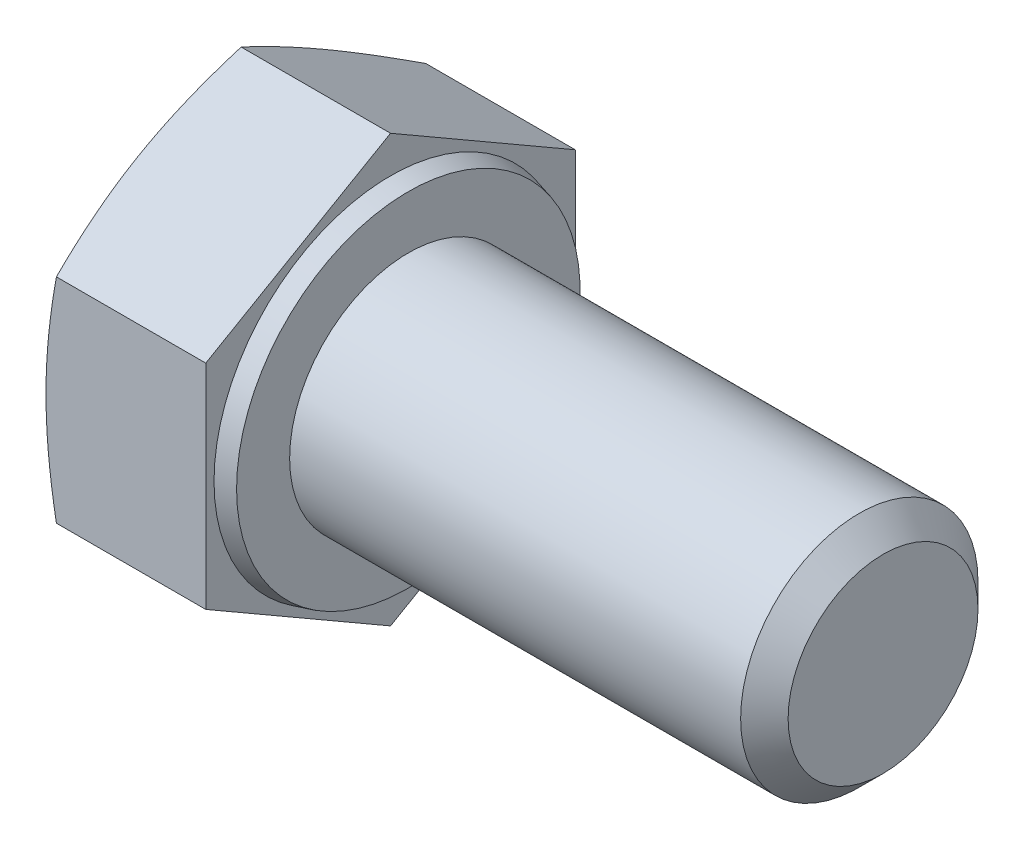
ISO-10303-21;
HEADER;
FILE_DESCRIPTION(('STEP AP214'),'2;1');
FILE_NAME('part.step','',(''),(''),'','','');
FILE_SCHEMA(('AUTOMOTIVE_DESIGN { 1 0 10303 214 1 1 1 1 }'));
ENDSEC;
DATA;
#1=APPLICATION_CONTEXT('core data for automotive mechanical design processes');
#2=APPLICATION_PROTOCOL_DEFINITION('international standard','automotive_design',2000,#1);
#3=PRODUCT_CONTEXT('',#1,'mechanical');
#4=PRODUCT('Part','Part','',(#3));
#5=PRODUCT_RELATED_PRODUCT_CATEGORY('part','',(#4));
#6=PRODUCT_DEFINITION_FORMATION('','',#4);
#7=PRODUCT_DEFINITION_CONTEXT('part definition',#1,'design');
#8=PRODUCT_DEFINITION('design','',#6,#7);
#9=PRODUCT_DEFINITION_SHAPE('','',#8);
#10=(LENGTH_UNIT() NAMED_UNIT(*) SI_UNIT(.MILLI.,.METRE.));
#11=(NAMED_UNIT(*) PLANE_ANGLE_UNIT() SI_UNIT($,.RADIAN.));
#12=(NAMED_UNIT(*) SI_UNIT($,.STERADIAN.) SOLID_ANGLE_UNIT());
#13=UNCERTAINTY_MEASURE_WITH_UNIT(LENGTH_MEASURE(1.E-05),#10,'distance_accuracy_value','');
#14=(GEOMETRIC_REPRESENTATION_CONTEXT(3) GLOBAL_UNCERTAINTY_ASSIGNED_CONTEXT((#13)) GLOBAL_UNIT_ASSIGNED_CONTEXT((#10,
#11,#12)) REPRESENTATION_CONTEXT('',''));
#15=CARTESIAN_POINT('',(0.,0.,0.));
#16=DIRECTION('',(0.,0.,1.));
#17=DIRECTION('',(1.,0.,0.));
#18=AXIS2_PLACEMENT_3D('',#15,#16,#17);
#19=CARTESIAN_POINT('',(16.5999999999999,-3.595,-6.22672265321011));
#20=DIRECTION('',(0.,-0.866025403784439,-0.5));
#21=DIRECTION('',(0.,0.5,-0.866025403784439));
#22=AXIS2_PLACEMENT_3D('',#19,#20,#21);
#23=PLANE('',#22);
#24=DIRECTION('',(-1.,0.,0.));
#25=VECTOR('',#24,1.);
#26=CARTESIAN_POINT('',(16.5999999999999,-7.19,0.));
#27=LINE('',#26,#25);
#28=CARTESIAN_POINT('',(0.,-7.19,0.));
#29=VERTEX_POINT('',#28);
#30=CARTESIAN_POINT('',(-5.03389102967511,-7.19,0.));
#31=VERTEX_POINT('',#30);
#32=EDGE_CURVE('E58',#29,#31,#27,.T.);
#33=ORIENTED_EDGE('',*,*,#32,.T.);
#34=CARTESIAN_POINT('',(-5.03384900100014,-7.19011547005384,0.0002));
#35=CARTESIAN_POINT('',(-5.08805963076519,-7.04122910407722,-0.257678750425791));
#36=CARTESIAN_POINT('',(-5.13737359308155,-6.89185177286806,-0.516407877579102));
#37=CARTESIAN_POINT('',(-5.22413389520894,-6.59212583670845,-1.0355484273537));
#38=CARTESIAN_POINT('',(-5.26157094835133,-6.44177656505055,-1.29596100474615));
#39=CARTESIAN_POINT('',(-5.32212431475841,-6.14177529234696,-1.81557845140411));
#40=CARTESIAN_POINT('',(-5.34537270513493,-5.99213014273963,-2.07477145363024));
#41=CARTESIAN_POINT('',(-5.37655533214507,-5.69248989384581,-2.59376358870692));
#42=CARTESIAN_POINT('',(-5.38449531124956,-5.54249494692291,-2.85356245765599));
#43=CARTESIAN_POINT('',(-5.38449531124956,-5.2425050530771,-3.37316019555412));
#44=CARTESIAN_POINT('',(-5.37655533214507,-5.09251010615419,-3.63295906450319));
#45=CARTESIAN_POINT('',(-5.34537270513493,-4.79286985726037,-4.15195119957987));
#46=CARTESIAN_POINT('',(-5.32212431475841,-4.64322470765305,-4.41114420180601));
#47=CARTESIAN_POINT('',(-5.26157094835133,-4.34322343494945,-4.93076164846397));
#48=CARTESIAN_POINT('',(-5.22413389520894,-4.19287416329156,-5.19117422585641));
#49=CARTESIAN_POINT('',(-5.13737359308155,-3.89314822713194,-5.71031477563101));
#50=CARTESIAN_POINT('',(-5.08805963076519,-3.74377089592278,-5.96904390278432));
#51=CARTESIAN_POINT('',(-5.03384900100014,-3.59488452994616,-6.22692265321011));
#52=B_SPLINE_CURVE_WITH_KNOTS('',3,(#34,#35,#36,#37,#38,#39,#40,#41,#42,#43,#44,#45,#46,#47,#48,
#49,#50,#51),.UNSPECIFIED.,.F.,.F.,(4,2,2,2,2,2,2,2,4),(0.,0.908095057252449,1.81689842260343,
2.71710763162562,3.61697908961632,4.51685054760702,5.41705975662921,6.32586312198019,
7.23395817923264),.UNSPECIFIED.);
#53=CARTESIAN_POINT('',(-5.03389102967511,-3.595,-6.22672265321011));
#54=VERTEX_POINT('',#53);
#55=EDGE_CURVE('E51',#31,#54,#52,.T.);
#56=ORIENTED_EDGE('',*,*,#55,.T.);
#57=DIRECTION('',(-1.,0.,0.));
#58=VECTOR('',#57,1.);
#59=CARTESIAN_POINT('',(16.5999999999999,-3.595,-6.22672265321011));
#60=LINE('',#59,#58);
#61=CARTESIAN_POINT('',(0.,-3.595,-6.22672265321011));
#62=VERTEX_POINT('',#61);
#63=EDGE_CURVE('E124',#62,#54,#60,.T.);
#64=ORIENTED_EDGE('',*,*,#63,.F.);
#65=DIRECTION('',(0.,-0.5,0.866025403784439));
#66=VECTOR('',#65,1.);
#67=CARTESIAN_POINT('',(0.,-3.595,-6.22672265321011));
#68=LINE('',#67,#66);
#69=EDGE_CURVE('E139',#62,#29,#68,.T.);
#70=ORIENTED_EDGE('',*,*,#69,.T.);
#71=EDGE_LOOP('',(#33,#56,#64,#70));
#72=FACE_BOUND('',#71,.T.);
#73=ADVANCED_FACE('F36',(#72),#23,.T.);
#74=CARTESIAN_POINT('',(16.5999999999999,3.595,-6.22672265321011));
#75=DIRECTION('',(0.,0.,-1.));
#76=DIRECTION('',(0.,1.,0.));
#77=AXIS2_PLACEMENT_3D('',#74,#75,#76);
#78=PLANE('',#77);
#79=ORIENTED_EDGE('',*,*,#63,.T.);
#80=CARTESIAN_POINT('',(-3.51290350463359,-9.51206244699165,-6.22672265321012));
#81=CARTESIAN_POINT('',(-3.59865067374366,-9.23040678020694,-6.22672265321012));
#82=CARTESIAN_POINT('',(-3.68339590180722,-8.948440403835,-6.22672265321012));
#83=CARTESIAN_POINT('',(-3.85032818164455,-8.38372806074036,-6.22672265321012));
#84=CARTESIAN_POINT('',(-3.93251503051058,-8.10098203410892,-6.22672265321012));
#85=CARTESIAN_POINT('',(-4.09391336009,-7.53406688733044,-6.22672265321012));
#86=CARTESIAN_POINT('',(-4.17311898619305,-7.24989609436889,-6.22672265321012));
#87=CARTESIAN_POINT('',(-4.32762595897665,-6.68049654285568,-6.22672265321012));
#88=CARTESIAN_POINT('',(-4.40292737592697,-6.39526780344452,-6.22672265321012));
#89=CARTESIAN_POINT('',(-4.54775778410175,-5.82709836820566,-6.22672265321012));
#90=CARTESIAN_POINT('',(-4.61734665667,-5.54417301266554,-6.22672265321011));
#91=CARTESIAN_POINT('',(-4.75059032929027,-4.97691372635876,-6.22672265321011));
#92=CARTESIAN_POINT('',(-4.81424502941142,-4.69257977195632,-6.22672265321011));
#93=CARTESIAN_POINT('',(-4.93413428437026,-4.12244081187139,-6.22672265321011));
#94=CARTESIAN_POINT('',(-4.99037139100831,-3.83663634741487,-6.22672265321011));
#95=CARTESIAN_POINT('',(-5.09371134025047,-3.26336845733878,-6.22672265321011));
#96=CARTESIAN_POINT('',(-5.14081448967723,-2.97590508777835,-6.22672265321011));
#97=CARTESIAN_POINT('',(-5.21930699352353,-2.43170060088507,-6.22672265321011));
#98=CARTESIAN_POINT('',(-5.2518662377399,-2.17512980718482,-6.22672265321011));
#99=CARTESIAN_POINT('',(-5.30696049565407,-1.66090521643882,-6.22672265321011));
#100=CARTESIAN_POINT('',(-5.32949580170818,-1.4032514512001,-6.22672265321011));
#101=CARTESIAN_POINT('',(-5.36345683516162,-0.887383641140857,-6.22672265321011));
#102=CARTESIAN_POINT('',(-5.37489039669814,-0.629170120469072,-6.22672265321011));
#103=CARTESIAN_POINT('',(-5.38606924306082,-0.112487483798661,-6.22672265321011));
#104=CARTESIAN_POINT('',(-5.38581460886695,0.145981630416715,-6.22672265321011));
#105=CARTESIAN_POINT('',(-5.37359991738923,0.663954843197887,-6.22672265321011));
#106=CARTESIAN_POINT('',(-5.36158028737254,0.923457513564079,-6.22672265321011));
#107=CARTESIAN_POINT('',(-5.32638854200036,1.44169898088408,-6.22672265321011));
#108=CARTESIAN_POINT('',(-5.30321615879705,1.70043775934188,-6.22672265321011));
#109=CARTESIAN_POINT('',(-5.24680158753448,2.21702436160621,-6.22672265321011));
#110=CARTESIAN_POINT('',(-5.21355075970606,2.47487122824474,-6.22672265321011));
#111=CARTESIAN_POINT('',(-5.1383262138086,2.98927496857798,-6.22672265321011));
#112=CARTESIAN_POINT('',(-5.09635245030345,3.24583183554621,-6.22672265321011));
#113=CARTESIAN_POINT('',(-5.00254996252867,3.77161154258582,-6.22672265321011));
#114=CARTESIAN_POINT('',(-4.95030790362126,4.0407599866922,-6.22672265321011));
#115=CARTESIAN_POINT('',(-4.83910100557231,4.57767329922066,-6.22672265321011));
#116=CARTESIAN_POINT('',(-4.78013565803658,4.84543806141054,-6.22672265321011));
#117=CARTESIAN_POINT('',(-4.65672193019494,5.37977561536939,-6.22672265321011));
#118=CARTESIAN_POINT('',(-4.59227195307975,5.64634803605647,-6.22672265321011));
#119=CARTESIAN_POINT('',(-4.45893792515359,6.17836938091286,-6.22672265321011));
#120=CARTESIAN_POINT('',(-4.39005398100717,6.44381833194503,-6.22672265321011));
#121=CARTESIAN_POINT('',(-4.24859250088054,6.97409102138935,-6.22672265321011));
#122=CARTESIAN_POINT('',(-4.17601034700023,7.2389135235188,-6.22672265321011));
#123=CARTESIAN_POINT('',(-4.02789200488949,7.76773266668567,-6.22672265321011));
#124=CARTESIAN_POINT('',(-3.95235577317997,8.0317292955058,-6.22672265321011));
#125=CARTESIAN_POINT('',(-3.7221641328738,8.82257156289593,-6.22672265321011));
#126=CARTESIAN_POINT('',(-3.56389961609156,9.3483659936652,-6.22672265321011));
#127=CARTESIAN_POINT('',(-3.24257396471912,10.3920660350929,-6.22672265321011));
#128=CARTESIAN_POINT('',(-3.07958583733744,10.9099943074093,-6.22672265321011));
#129=CARTESIAN_POINT('',(-2.74898726190027,11.9443978872245,-6.22672265321011));
#130=CARTESIAN_POINT('',(-2.5813765914879,12.4608731235069,-6.22672265321011));
#131=CARTESIAN_POINT('',(-2.24342037080104,13.4907541310804,-6.22672265321011));
#132=CARTESIAN_POINT('',(-2.07308761745729,14.0041641118251,-6.22672265321011));
#133=CARTESIAN_POINT('',(-1.81570195648708,14.77362367697,-6.22672265321011));
#134=CARTESIAN_POINT('',(-1.7295958228759,15.0299906446384,-6.22672265321011));
#135=CARTESIAN_POINT('',(-1.55682750223247,15.5425364828865,-6.22672265321011));
#136=CARTESIAN_POINT('',(-1.47016531655149,15.7987153539217,-6.22672265321011));
#137=CARTESIAN_POINT('',(-1.38326239219643,16.0548125224615,-6.22672265321011));
#138=B_SPLINE_CURVE_WITH_KNOTS('',3,(#80,#81,#82,#83,#84,#85,#86,#87,#88,#89,#90,#91,#92,#93,
#94,#95,#96,#97,#98,#99,#100,#101,#102,#103,#104,#105,#106,#107,#108,#109,#110,#111,#112,#113,
#114,#115,#116,#117,#118,#119,#120,#121,#122,#123,#124,#125,#126,#127,#128,#129,#130,#131,#132,
#133,#134,#135,#136,#137),.UNSPECIFIED.,.F.,.F.,(4,2,2,2,2,2,2,2,2,2,2,2,2,2,2,2,2,2,2,2,2,2,2,
2,2,2,2,2,4),(0.,0.883262987783514,1.76659585051986,2.65158142631617,3.53655106819753,
4.41057390114665,5.28461144989435,6.15834752361641,7.03205424221161,7.80776909780132,
8.58346132755328,9.35860577805133,10.1337448580756,10.9128293116603,11.6919324769004,
12.4717054281399,13.2514824411686,14.0738921575776,14.8963641033477,15.7190763303775,
16.5417687734372,17.3655149556542,18.1892732666067,19.8364902464891,21.4653706257557,
23.094329495726,24.7171047884872,25.5284270364797,26.3397473136057),.UNSPECIFIED.);
#139=CARTESIAN_POINT('',(-5.03389102967511,3.595,-6.22672265321011));
#140=VERTEX_POINT('',#139);
#141=EDGE_CURVE('E180',#54,#140,#138,.T.);
#142=ORIENTED_EDGE('',*,*,#141,.T.);
#143=DIRECTION('',(-1.,0.,0.));
#144=VECTOR('',#143,1.);
#145=CARTESIAN_POINT('',(16.5999999999999,3.595,-6.22672265321011));
#146=LINE('',#145,#144);
#147=CARTESIAN_POINT('',(0.,3.595,-6.22672265321011));
#148=VERTEX_POINT('',#147);
#149=EDGE_CURVE('E114',#148,#140,#146,.T.);
#150=ORIENTED_EDGE('',*,*,#149,.F.);
#151=DIRECTION('',(0.,-1.,0.));
#152=VECTOR('',#151,1.);
#153=CARTESIAN_POINT('',(0.,7.19,-6.22672265321011));
#154=LINE('',#153,#152);
#155=EDGE_CURVE('E137',#148,#62,#154,.T.);
#156=ORIENTED_EDGE('',*,*,#155,.T.);
#157=EDGE_LOOP('',(#79,#142,#150,#156));
#158=FACE_BOUND('',#157,.T.);
#159=ADVANCED_FACE('F155',(#158),#78,.T.);
#160=CARTESIAN_POINT('',(16.5999999999999,7.19,0.));
#161=DIRECTION('',(0.,0.866025403784439,-0.5));
#162=DIRECTION('',(0.,0.5,0.866025403784439));
#163=AXIS2_PLACEMENT_3D('',#160,#161,#162);
#164=PLANE('',#163);
#165=ORIENTED_EDGE('',*,*,#149,.T.);
#166=CARTESIAN_POINT('',(-5.03384900100014,3.59488452994616,-6.22692265321011));
#167=CARTESIAN_POINT('',(-5.08805963076519,3.74377089592278,-5.96904390278432));
#168=CARTESIAN_POINT('',(-5.13737359308155,3.89314822713194,-5.71031477563101));
#169=CARTESIAN_POINT('',(-5.22413389520894,4.19287416329156,-5.19117422585641));
#170=CARTESIAN_POINT('',(-5.26157094835133,4.34322343494945,-4.93076164846397));
#171=CARTESIAN_POINT('',(-5.32212431475841,4.64322470765305,-4.41114420180601));
#172=CARTESIAN_POINT('',(-5.34537270513493,4.79286985726037,-4.15195119957987));
#173=CARTESIAN_POINT('',(-5.37655533214507,5.09251010615419,-3.63295906450319));
#174=CARTESIAN_POINT('',(-5.38449531124956,5.2425050530771,-3.37316019555412));
#175=CARTESIAN_POINT('',(-5.38449531124956,5.54249494692291,-2.85356245765599));
#176=CARTESIAN_POINT('',(-5.37655533214507,5.69248989384581,-2.59376358870692));
#177=CARTESIAN_POINT('',(-5.34537270513493,5.99213014273963,-2.07477145363024));
#178=CARTESIAN_POINT('',(-5.32212431475841,6.14177529234696,-1.81557845140411));
#179=CARTESIAN_POINT('',(-5.26157094835133,6.44177656505056,-1.29596100474615));
#180=CARTESIAN_POINT('',(-5.22413389520894,6.59212583670845,-1.0355484273537));
#181=CARTESIAN_POINT('',(-5.13737359308155,6.89185177286806,-0.516407877579103));
#182=CARTESIAN_POINT('',(-5.08805963076518,7.04122910407722,-0.257678750425792));
#183=CARTESIAN_POINT('',(-5.03384900100014,7.19011547005384,0.000199999999999059));
#184=B_SPLINE_CURVE_WITH_KNOTS('',3,(#166,#167,#168,#169,#170,#171,#172,#173,#174,#175,#176,
#177,#178,#179,#180,#181,#182,#183),.UNSPECIFIED.,.F.,.F.,(4,2,2,2,2,2,2,2,4),(0.,
0.908095057252449,1.81689842260343,2.71710763162562,3.61697908961632,4.51685054760702,
5.41705975662921,6.32586312198019,7.23395817923264),.UNSPECIFIED.);
#185=CARTESIAN_POINT('',(-5.03389102967511,7.19,0.));
#186=VERTEX_POINT('',#185);
#187=EDGE_CURVE('E107',#140,#186,#184,.T.);
#188=ORIENTED_EDGE('',*,*,#187,.T.);
#189=DIRECTION('',(-1.,0.,0.));
#190=VECTOR('',#189,1.);
#191=CARTESIAN_POINT('',(16.5999999999999,7.19,0.));
#192=LINE('',#191,#190);
#193=CARTESIAN_POINT('',(0.,7.19,0.));
#194=VERTEX_POINT('',#193);
#195=EDGE_CURVE('E106',#194,#186,#192,.T.);
#196=ORIENTED_EDGE('',*,*,#195,.F.);
#197=DIRECTION('',(0.,-0.5,-0.866025403784439));
#198=VECTOR('',#197,1.);
#199=CARTESIAN_POINT('',(0.,7.19,0.));
#200=LINE('',#199,#198);
#201=EDGE_CURVE('E135',#194,#148,#200,.T.);
#202=ORIENTED_EDGE('',*,*,#201,.T.);
#203=EDGE_LOOP('',(#165,#188,#196,#202));
#204=FACE_BOUND('',#203,.T.);
#205=ADVANCED_FACE('F161',(#204),#164,.T.);
#206=CARTESIAN_POINT('',(16.5999999999999,3.595,6.22672265321012));
#207=DIRECTION('',(0.,0.866025403784439,0.5));
#208=DIRECTION('',(0.,-0.5,0.866025403784439));
#209=AXIS2_PLACEMENT_3D('',#206,#207,#208);
#210=PLANE('',#209);
#211=ORIENTED_EDGE('',*,*,#195,.T.);
#212=CARTESIAN_POINT('',(-5.03384900100014,7.19011547005384,-0.000200000000000765));
#213=CARTESIAN_POINT('',(-5.08805963076518,7.04122910407722,0.25767875042579));
#214=CARTESIAN_POINT('',(-5.13737359308155,6.89185177286806,0.516407877579101));
#215=CARTESIAN_POINT('',(-5.22413389520894,6.59212583670845,1.0355484273537));
#216=CARTESIAN_POINT('',(-5.26157094835133,6.44177656505056,1.29596100474615));
#217=CARTESIAN_POINT('',(-5.32212431475841,6.14177529234696,1.81557845140411));
#218=CARTESIAN_POINT('',(-5.34537270513493,5.99213014273963,2.07477145363024));
#219=CARTESIAN_POINT('',(-5.37655533214507,5.69248989384581,2.59376358870692));
#220=CARTESIAN_POINT('',(-5.38449531124956,5.54249494692291,2.85356245765599));
#221=CARTESIAN_POINT('',(-5.38449531124956,5.2425050530771,3.37316019555412));
#222=CARTESIAN_POINT('',(-5.37655533214507,5.09251010615419,3.63295906450319));
#223=CARTESIAN_POINT('',(-5.34537270513493,4.79286985726037,4.15195119957987));
#224=CARTESIAN_POINT('',(-5.32212431475841,4.64322470765305,4.41114420180601));
#225=CARTESIAN_POINT('',(-5.26157094835133,4.34322343494945,4.93076164846397));
#226=CARTESIAN_POINT('',(-5.22413389520894,4.19287416329156,5.19117422585641));
#227=CARTESIAN_POINT('',(-5.13737359308155,3.89314822713194,5.71031477563101));
#228=CARTESIAN_POINT('',(-5.08805963076518,3.74377089592278,5.96904390278432));
#229=CARTESIAN_POINT('',(-5.03384900100014,3.59488452994616,6.22692265321012));
#230=B_SPLINE_CURVE_WITH_KNOTS('',3,(#212,#213,#214,#215,#216,#217,#218,#219,#220,#221,#222,
#223,#224,#225,#226,#227,#228,#229),.UNSPECIFIED.,.F.,.F.,(4,2,2,2,2,2,2,2,4),(0.,
0.908095057252449,1.81689842260343,2.71710763162562,3.61697908961632,4.51685054760702,
5.41705975662921,6.32586312198019,7.23395817923264),.UNSPECIFIED.);
#231=CARTESIAN_POINT('',(-5.03389102967511,3.595,6.22672265321012));
#232=VERTEX_POINT('',#231);
#233=EDGE_CURVE('E91',#186,#232,#230,.T.);
#234=ORIENTED_EDGE('',*,*,#233,.T.);
#235=DIRECTION('',(-1.,0.,0.));
#236=VECTOR('',#235,1.);
#237=CARTESIAN_POINT('',(16.5999999999999,3.595,6.22672265321012));
#238=LINE('',#237,#236);
#239=CARTESIAN_POINT('',(0.,3.595,6.22672265321012));
#240=VERTEX_POINT('',#239);
#241=EDGE_CURVE('E103',#240,#232,#238,.T.);
#242=ORIENTED_EDGE('',*,*,#241,.F.);
#243=DIRECTION('',(0.,0.5,-0.866025403784439));
#244=VECTOR('',#243,1.);
#245=CARTESIAN_POINT('',(0.,7.19,0.));
#246=LINE('',#245,#244);
#247=EDGE_CURVE('E133',#240,#194,#246,.T.);
#248=ORIENTED_EDGE('',*,*,#247,.T.);
#249=EDGE_LOOP('',(#211,#234,#242,#248));
#250=FACE_BOUND('',#249,.T.);
#251=ADVANCED_FACE('F102',(#250),#210,.T.);
#252=CARTESIAN_POINT('',(16.5999999999999,-3.595,6.22672265321012));
#253=DIRECTION('',(0.,0.,1.));
#254=DIRECTION('',(1.,0.,0.));
#255=AXIS2_PLACEMENT_3D('',#252,#253,#254);
#256=PLANE('',#255);
#257=ORIENTED_EDGE('',*,*,#241,.T.);
#258=CARTESIAN_POINT('',(-3.51290508611603,-9.51205725371464,6.22672265321012));
#259=CARTESIAN_POINT('',(-3.59865217996763,-9.2304017880567,6.22672265321012));
#260=CARTESIAN_POINT('',(-3.68339733297397,-8.94843561292577,6.22672265321012));
#261=CARTESIAN_POINT('',(-3.85032946359841,-8.38372367274364,6.22672265321012));
#262=CARTESIAN_POINT('',(-3.93251623830892,-8.10097784778373,6.22672265321012));
#263=CARTESIAN_POINT('',(-4.09391442059783,-7.53406310622304,6.22672265321012));
#264=CARTESIAN_POINT('',(-4.17311997357866,-7.24989251681173,6.22672265321012));
#265=CARTESIAN_POINT('',(-4.32762680242183,-6.68049337324663,6.22672265321012));
#266=CARTESIAN_POINT('',(-4.40292814855382,-6.3952648382333,6.22672265321012));
#267=CARTESIAN_POINT('',(-4.54775841953013,-5.82709581042908,6.22672265321012));
#268=CARTESIAN_POINT('',(-4.61734722567375,-5.54417065791081,6.22672265321012));
#269=CARTESIAN_POINT('',(-4.75059077074392,-4.97691177927585,6.22672265321012));
#270=CARTESIAN_POINT('',(-4.81424540974025,-4.69257802952355,6.22672265321012));
#271=CARTESIAN_POINT('',(-4.93413455045104,-4.12243948030663,6.22672265321012));
#272=CARTESIAN_POINT('',(-4.99037160395253,-3.83663522206503,6.22672265321012));
#273=CARTESIAN_POINT('',(-5.09371145826456,-3.26336774677179,6.22672265321012));
#274=CARTESIAN_POINT('',(-5.14081456589485,-2.97590458577873,6.22672265321012));
#275=CARTESIAN_POINT('',(-5.21930703944179,-2.43170025907276,6.22672265321012));
#276=CARTESIAN_POINT('',(-5.25186628549319,-2.17512941557449,6.22672265321012));
#277=CARTESIAN_POINT('',(-5.30696054251941,-1.66090472496614,6.22672265321012));
#278=CARTESIAN_POINT('',(-5.32949584585066,-1.40325090966308,6.22672265321012));
#279=CARTESIAN_POINT('',(-5.36345686891723,-0.88738299958265,6.22672265321012));
#280=CARTESIAN_POINT('',(-5.37489042279491,-0.62916942895409,6.22672265321012));
#281=CARTESIAN_POINT('',(-5.38606924904272,-0.112486692775754,6.22672265321012));
#282=CARTESIAN_POINT('',(-5.38581460239283,0.145982470990777,6.22672265321012));
#283=CARTESIAN_POINT('',(-5.37359988177924,0.663955784214362,6.22672265321012));
#284=CARTESIAN_POINT('',(-5.36158023497983,0.923458505466206,6.22672265321012));
#285=CARTESIAN_POINT('',(-5.3263884528181,1.44170007368661,6.22672265321012));
#286=CARTESIAN_POINT('',(-5.30321604960751,1.7004389021591,6.22672265321012));
#287=CARTESIAN_POINT('',(-5.24680143623883,2.21702560380556,6.22672265321012));
#288=CARTESIAN_POINT('',(-5.21355058630372,2.47487251981011,6.22672265321012));
#289=CARTESIAN_POINT('',(-5.13832599511556,2.98927635818654,6.22672265321012));
#290=CARTESIAN_POINT('',(-5.09635220842638,3.24583327383193,6.22672265321012));
#291=CARTESIAN_POINT('',(-5.00254968168844,3.77161302966225,6.22672265321012));
#292=CARTESIAN_POINT('',(-4.95030760851958,4.04076147413116,6.22672265321012));
#293=CARTESIAN_POINT('',(-4.83910068432238,4.57767478754593,6.22672265321012));
#294=CARTESIAN_POINT('',(-4.7801353249004,4.8454395502597,6.22672265321012));
#295=CARTESIAN_POINT('',(-4.65672157529754,5.37977710544744,6.22672265321012));
#296=CARTESIAN_POINT('',(-4.59227158830931,5.64634952683991,6.22672265321012));
#297=CARTESIAN_POINT('',(-4.45893754227179,6.17837087337752,6.22672265321012));
#298=CARTESIAN_POINT('',(-4.39005358988696,6.4438198253855,6.22672265321012));
#299=CARTESIAN_POINT('',(-4.24859209472407,6.97409251652315,6.22672265321012));
#300=CARTESIAN_POINT('',(-4.17600993405459,7.2389150193723,6.22672265321012));
#301=CARTESIAN_POINT('',(-4.02789157942869,7.76773416420793,6.22672265321012));
#302=CARTESIAN_POINT('',(-3.95235534199323,8.03173079397712,6.22672265321012));
#303=CARTESIAN_POINT('',(-3.72216368574898,8.8225730645819,6.22672265321012));
#304=CARTESIAN_POINT('',(-3.5638991600107,9.34836749791472,6.22672265321012));
#305=CARTESIAN_POINT('',(-3.2425734978752,10.3920675289828,6.22672265321012));
#306=CARTESIAN_POINT('',(-3.07958536886221,10.9099957884314,6.22672265321012));
#307=CARTESIAN_POINT('',(-2.74898679178007,11.9443993429674,6.22672265321012));
#308=CARTESIAN_POINT('',(-2.58137612135426,12.4608745668382,6.22672265321012));
#309=CARTESIAN_POINT('',(-2.24341990106824,13.4907555519379,6.22672265321012));
#310=CARTESIAN_POINT('',(-2.07308714812183,14.0041655226146,6.22672265321012));
#311=CARTESIAN_POINT('',(-1.81570148828254,14.7736250728444,6.22672265321012));
#312=CARTESIAN_POINT('',(-1.72959535513498,15.0299920355796,6.22672265321012));
#313=CARTESIAN_POINT('',(-1.55682703557139,15.542537864011,6.22672265321012));
#314=CARTESIAN_POINT('',(-1.47016485050663,15.7987167301625,6.22672265321012));
#315=CARTESIAN_POINT('',(-1.38326192683059,16.0548138938391,6.22672265321012));
#316=B_SPLINE_CURVE_WITH_KNOTS('',3,(#258,#259,#260,#261,#262,#263,#264,#265,#266,#267,#268,
#269,#270,#271,#272,#273,#274,#275,#276,#277,#278,#279,#280,#281,#282,#283,#284,#285,#286,#287,
#288,#289,#290,#291,#292,#293,#294,#295,#296,#297,#298,#299,#300,#301,#302,#303,#304,#305,#306,
#307,#308,#309,#310,#311,#312,#313,#314,#315),.UNSPECIFIED.,.F.,.F.,(4,2,2,2,2,2,2,2,2,2,2,2,2,
2,2,2,2,2,2,2,2,2,2,2,2,2,2,2,4),(0.,0.883262344799887,1.76659456447282,2.6515794931495,
3.53654848794066,4.41057068190114,5.28460759156824,6.15834302768208,7.03204910893083,
7.80776411328184,8.58345649179181,9.35860109082504,10.1337403193849,10.9128249276724,
11.6919282476459,12.471701354226,13.2514785225995,14.0738882483056,14.8963602033275,
15.7190724394093,16.5417648915329,17.365511081231,18.1892693996557,19.8364863946962,
21.4653667386268,23.0943255732039,24.7171008369271,25.5284230704479,26.3397433331034),.UNSPECIFIED.);
#317=CARTESIAN_POINT('',(-5.03389102967511,-3.595,6.22672265321011));
#318=VERTEX_POINT('',#317);
#319=EDGE_CURVE('E87',#232,#318,#316,.F.);
#320=ORIENTED_EDGE('',*,*,#319,.T.);
#321=DIRECTION('',(-1.,0.,0.));
#322=VECTOR('',#321,1.);
#323=CARTESIAN_POINT('',(16.5999999999999,-3.595,6.22672265321012));
#324=LINE('',#323,#322);
#325=CARTESIAN_POINT('',(0.,-3.595,6.22672265321012));
#326=VERTEX_POINT('',#325);
#327=EDGE_CURVE('E112',#326,#318,#324,.T.);
#328=ORIENTED_EDGE('',*,*,#327,.F.);
#329=DIRECTION('',(0.,1.,0.));
#330=VECTOR('',#329,1.);
#331=CARTESIAN_POINT('',(0.,7.19,6.22672265321012));
#332=LINE('',#331,#330);
#333=EDGE_CURVE('E111',#326,#240,#332,.T.);
#334=ORIENTED_EDGE('',*,*,#333,.T.);
#335=EDGE_LOOP('',(#257,#320,#328,#334));
#336=FACE_BOUND('',#335,.T.);
#337=ADVANCED_FACE('F109',(#336),#256,.T.);
#338=CARTESIAN_POINT('',(16.5999999999999,-7.19,0.));
#339=DIRECTION('',(0.,-0.866025403784439,0.5));
#340=DIRECTION('',(0.,-0.5,-0.866025403784439));
#341=AXIS2_PLACEMENT_3D('',#338,#339,#340);
#342=PLANE('',#341);
#343=ORIENTED_EDGE('',*,*,#327,.T.);
#344=CARTESIAN_POINT('',(-5.03384900100014,-3.59488452994616,6.22692265321012));
#345=CARTESIAN_POINT('',(-5.08805963076519,-3.74377089592278,5.96904390278433));
#346=CARTESIAN_POINT('',(-5.13737359308155,-3.89314822713194,5.71031477563101));
#347=CARTESIAN_POINT('',(-5.22413389520894,-4.19287416329155,5.19117422585641));
#348=CARTESIAN_POINT('',(-5.26157094835133,-4.34322343494944,4.93076164846397));
#349=CARTESIAN_POINT('',(-5.32212431475841,-4.64322470765304,4.41114420180601));
#350=CARTESIAN_POINT('',(-5.34537270513493,-4.79286985726037,4.15195119957987));
#351=CARTESIAN_POINT('',(-5.37655533214507,-5.09251010615419,3.63295906450319));
#352=CARTESIAN_POINT('',(-5.38449531124956,-5.24250505307709,3.37316019555413));
#353=CARTESIAN_POINT('',(-5.38449531124956,-5.5424949469229,2.85356245765599));
#354=CARTESIAN_POINT('',(-5.37655533214507,-5.69248989384581,2.59376358870692));
#355=CARTESIAN_POINT('',(-5.34537270513493,-5.99213014273963,2.07477145363024));
#356=CARTESIAN_POINT('',(-5.32212431475841,-6.14177529234695,1.81557845140411));
#357=CARTESIAN_POINT('',(-5.26157094835133,-6.44177656505055,1.29596100474615));
#358=CARTESIAN_POINT('',(-5.22413389520894,-6.59212583670844,1.0355484273537));
#359=CARTESIAN_POINT('',(-5.13737359308155,-6.89185177286806,0.516407877579102));
#360=CARTESIAN_POINT('',(-5.08805963076519,-7.04122910407722,0.257678750425791));
#361=CARTESIAN_POINT('',(-5.03384900100014,-7.19011547005384,-0.000200000000000184));
#362=B_SPLINE_CURVE_WITH_KNOTS('',3,(#344,#345,#346,#347,#348,#349,#350,#351,#352,#353,#354,
#355,#356,#357,#358,#359,#360,#361),.UNSPECIFIED.,.F.,.F.,(4,2,2,2,2,2,2,2,4),(0.,
0.908095057252449,1.81689842260343,2.71710763162562,3.61697908961632,4.51685054760702,
5.41705975662921,6.32586312198019,7.23395817923264),.UNSPECIFIED.);
#363=EDGE_CURVE('E93',#318,#31,#362,.T.);
#364=ORIENTED_EDGE('',*,*,#363,.T.);
#365=ORIENTED_EDGE('',*,*,#32,.F.);
#366=DIRECTION('',(0.,0.5,0.866025403784439));
#367=VECTOR('',#366,1.);
#368=CARTESIAN_POINT('',(0.,-3.595,6.22672265321011));
#369=LINE('',#368,#367);
#370=EDGE_CURVE('E130',#29,#326,#369,.T.);
#371=ORIENTED_EDGE('',*,*,#370,.T.);
#372=EDGE_LOOP('',(#343,#364,#365,#371));
#373=FACE_BOUND('',#372,.T.);
#374=ADVANCED_FACE('F167',(#373),#342,.T.);
#375=CARTESIAN_POINT('',(0.,7.19,0.));
#376=DIRECTION('',(-1.,0.,0.));
#377=DIRECTION('',(0.,0.,1.));
#378=AXIS2_PLACEMENT_3D('',#375,#376,#377);
#379=PLANE('',#378);
#380=CARTESIAN_POINT('',(0.,0.,0.));
#381=DIRECTION('',(-1.,0.,0.));
#382=DIRECTION('',(0.,0.,1.));
#383=AXIS2_PLACEMENT_3D('',#380,#381,#382);
#384=CIRCLE('',#383,5.94897459621555);
#385=CARTESIAN_POINT('',(0.,0.,5.94897459621555));
#386=VERTEX_POINT('',#385);
#387=EDGE_CURVE('E127',#386,#386,#384,.T.);
#388=ORIENTED_EDGE('',*,*,#387,.T.);
#389=EDGE_LOOP('',(#388));
#390=FACE_BOUND('',#389,.T.);
#391=ORIENTED_EDGE('',*,*,#69,.F.);
#392=ORIENTED_EDGE('',*,*,#155,.F.);
#393=ORIENTED_EDGE('',*,*,#201,.F.);
#394=ORIENTED_EDGE('',*,*,#247,.F.);
#395=ORIENTED_EDGE('',*,*,#333,.F.);
#396=ORIENTED_EDGE('',*,*,#370,.F.);
#397=EDGE_LOOP('',(#391,#392,#393,#394,#395,#396));
#398=FACE_BOUND('',#397,.T.);
#399=ADVANCED_FACE('F224',(#390,#398),#379,.F.);
#400=CARTESIAN_POINT('',(0.599999999999934,0.,0.));
#401=DIRECTION('',(-1.,0.,0.));
#402=DIRECTION('',(0.,0.,1.));
#403=AXIS2_PLACEMENT_3D('',#400,#401,#402);
#404=CONICAL_SURFACE('',#403,5.78820508075687,0.261799387799173);
#405=ORIENTED_EDGE('',*,*,#387,.F.);
#406=EDGE_LOOP('',(#405));
#407=FACE_BOUND('',#406,.T.);
#408=CARTESIAN_POINT('',(0.599999999999934,0.,0.));
#409=DIRECTION('',(-1.,0.,0.));
#410=DIRECTION('',(0.,0.,1.));
#411=AXIS2_PLACEMENT_3D('',#408,#409,#410);
#412=CIRCLE('',#411,5.78820508075687);
#413=CARTESIAN_POINT('',(0.599999999999934,0.,5.78820508075687));
#414=VERTEX_POINT('',#413);
#415=EDGE_CURVE('E123',#414,#414,#412,.T.);
#416=ORIENTED_EDGE('',*,*,#415,.T.);
#417=EDGE_LOOP('',(#416));
#418=FACE_BOUND('',#417,.T.);
#419=ADVANCED_FACE('F228',(#407,#418),#404,.T.);
#420=CARTESIAN_POINT('',(0.6,5.78820508075687,0.));
#421=DIRECTION('',(-1.,0.,0.));
#422=DIRECTION('',(0.,0.,1.));
#423=AXIS2_PLACEMENT_3D('',#420,#421,#422);
#424=PLANE('',#423);
#425=ORIENTED_EDGE('',*,*,#415,.F.);
#426=EDGE_LOOP('',(#425));
#427=FACE_BOUND('',#426,.T.);
#428=CARTESIAN_POINT('',(0.599999999999934,0.,0.));
#429=DIRECTION('',(-1.,0.,0.));
#430=DIRECTION('',(0.,0.,1.));
#431=AXIS2_PLACEMENT_3D('',#428,#429,#430);
#432=CIRCLE('',#431,4.);
#433=CARTESIAN_POINT('',(0.599999999999934,0.,4.));
#434=VERTEX_POINT('',#433);
#435=EDGE_CURVE('E120',#434,#434,#432,.T.);
#436=ORIENTED_EDGE('',*,*,#435,.T.);
#437=EDGE_LOOP('',(#436));
#438=FACE_BOUND('',#437,.T.);
#439=ADVANCED_FACE('F247',(#427,#438),#424,.F.);
#440=CARTESIAN_POINT('',(-1000.,0.,0.));
#441=DIRECTION('',(-1.,0.,0.));
#442=DIRECTION('',(0.,0.,1.));
#443=AXIS2_PLACEMENT_3D('',#440,#441,#442);
#444=CYLINDRICAL_SURFACE('',#443,4.);
#445=CARTESIAN_POINT('',(15.7999999999998,0.,0.));
#446=DIRECTION('',(-1.,0.,0.));
#447=DIRECTION('',(0.,0.,1.));
#448=AXIS2_PLACEMENT_3D('',#445,#446,#447);
#449=CIRCLE('',#448,4.);
#450=CARTESIAN_POINT('',(15.7999999999998,0.,4.));
#451=VERTEX_POINT('',#450);
#452=EDGE_CURVE('E44',#451,#451,#449,.T.);
#453=ORIENTED_EDGE('',*,*,#452,.T.);
#454=EDGE_LOOP('',(#453));
#455=FACE_BOUND('',#454,.T.);
#456=ORIENTED_EDGE('',*,*,#435,.F.);
#457=EDGE_LOOP('',(#456));
#458=FACE_BOUND('',#457,.T.);
#459=ADVANCED_FACE('F143',(#455,#458),#444,.T.);
#460=CARTESIAN_POINT('',(16.6,4.,0.));
#461=DIRECTION('',(-1.,0.,0.));
#462=DIRECTION('',(0.,0.,1.));
#463=AXIS2_PLACEMENT_3D('',#460,#461,#462);
#464=PLANE('',#463);
#465=CARTESIAN_POINT('',(16.6,0.,0.));
#466=DIRECTION('',(-1.,0.,0.));
#467=DIRECTION('',(0.,0.,1.));
#468=AXIS2_PLACEMENT_3D('',#465,#466,#467);
#469=CIRCLE('',#468,3.19999999999983);
#470=CARTESIAN_POINT('',(16.6,0.,3.19999999999983));
#471=VERTEX_POINT('',#470);
#472=EDGE_CURVE('E12',#471,#471,#469,.F.);
#473=ORIENTED_EDGE('',*,*,#472,.T.);
#474=EDGE_LOOP('',(#473));
#475=FACE_BOUND('',#474,.T.);
#476=ADVANCED_FACE('F170',(#475),#464,.F.);
#477=CARTESIAN_POINT('',(-5.44999999999995,0.,0.));
#478=DIRECTION('',(1.,0.,0.));
#479=DIRECTION('',(0.,0.,-1.));
#480=AXIS2_PLACEMENT_3D('',#477,#478,#479);
#481=CONICAL_SURFACE('',#480,6.04675,1.22173047639602);
#482=ORIENTED_EDGE('',*,*,#363,.F.);
#483=ORIENTED_EDGE('',*,*,#319,.F.);
#484=ORIENTED_EDGE('',*,*,#233,.F.);
#485=ORIENTED_EDGE('',*,*,#187,.F.);
#486=ORIENTED_EDGE('',*,*,#141,.F.);
#487=ORIENTED_EDGE('',*,*,#55,.F.);
#488=EDGE_LOOP('',(#482,#483,#484,#485,#486,#487));
#489=FACE_BOUND('',#488,.T.);
#490=CARTESIAN_POINT('',(-5.44999999999995,0.,0.));
#491=DIRECTION('',(-1.,0.,0.));
#492=DIRECTION('',(0.,0.,1.));
#493=AXIS2_PLACEMENT_3D('',#490,#491,#492);
#494=CIRCLE('',#493,6.04675);
#495=CARTESIAN_POINT('',(-5.44999999999995,0.,6.04675));
#496=VERTEX_POINT('',#495);
#497=EDGE_CURVE('E241',#496,#496,#494,.T.);
#498=ORIENTED_EDGE('',*,*,#497,.F.);
#499=EDGE_LOOP('',(#498));
#500=FACE_BOUND('',#499,.T.);
#501=ADVANCED_FACE('F89',(#489,#500),#481,.T.);
#502=CARTESIAN_POINT('',(-5.45,0.,0.));
#503=DIRECTION('',(1.,0.,0.));
#504=DIRECTION('',(0.,0.,-1.));
#505=AXIS2_PLACEMENT_3D('',#502,#503,#504);
#506=PLANE('',#505);
#507=ORIENTED_EDGE('',*,*,#497,.T.);
#508=EDGE_LOOP('',(#507));
#509=FACE_BOUND('',#508,.T.);
#510=ADVANCED_FACE('F147',(#509),#506,.F.);
#511=CARTESIAN_POINT('',(15.7999999999998,0.,0.));
#512=DIRECTION('',(-1.,0.,0.));
#513=DIRECTION('',(0.,0.,1.));
#514=AXIS2_PLACEMENT_3D('',#511,#512,#513);
#515=CONICAL_SURFACE('',#514,4.,0.785398163397438);
#516=ORIENTED_EDGE('',*,*,#472,.F.);
#517=EDGE_LOOP('',(#516));
#518=FACE_BOUND('',#517,.T.);
#519=ORIENTED_EDGE('',*,*,#452,.F.);
#520=EDGE_LOOP('',(#519));
#521=FACE_BOUND('',#520,.T.);
#522=ADVANCED_FACE('F38',(#518,#521),#515,.T.);
#523=CLOSED_SHELL('',(#73,#159,#205,#251,#337,#374,#399,#419,#439,#459,#476,#501,#510,#522));
#524=MANIFOLD_SOLID_BREP('B2',#523);
#525=ADVANCED_BREP_SHAPE_REPRESENTATION('',(#18,#524),#14);
#526=SHAPE_DEFINITION_REPRESENTATION(#9,#525);
ENDSEC;
END-ISO-10303-21;
